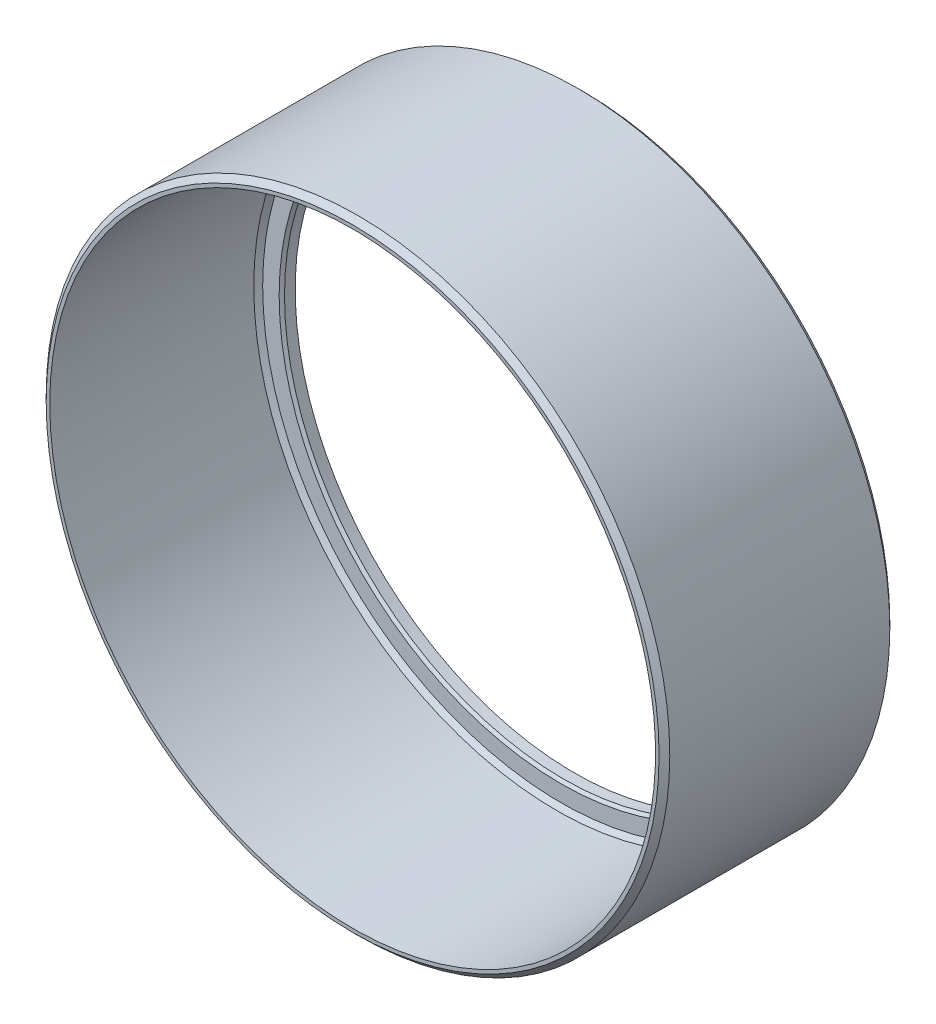
ISO-10303-21;
HEADER;
FILE_DESCRIPTION(('STEP AP214'),'2;1');
FILE_NAME('part.step','',(''),(''),'','','');
FILE_SCHEMA(('AUTOMOTIVE_DESIGN { 1 0 10303 214 1 1 1 1 }'));
ENDSEC;
DATA;
#1=APPLICATION_CONTEXT('core data for automotive mechanical design processes');
#2=APPLICATION_PROTOCOL_DEFINITION('international standard','automotive_design',2000,#1);
#3=PRODUCT_CONTEXT('',#1,'mechanical');
#4=PRODUCT('Part','Part','',(#3));
#5=PRODUCT_RELATED_PRODUCT_CATEGORY('part','',(#4));
#6=PRODUCT_DEFINITION_FORMATION('','',#4);
#7=PRODUCT_DEFINITION_CONTEXT('part definition',#1,'design');
#8=PRODUCT_DEFINITION('design','',#6,#7);
#9=PRODUCT_DEFINITION_SHAPE('','',#8);
#10=(LENGTH_UNIT() NAMED_UNIT(*) SI_UNIT(.MILLI.,.METRE.));
#11=(NAMED_UNIT(*) PLANE_ANGLE_UNIT() SI_UNIT($,.RADIAN.));
#12=(NAMED_UNIT(*) SI_UNIT($,.STERADIAN.) SOLID_ANGLE_UNIT());
#13=UNCERTAINTY_MEASURE_WITH_UNIT(LENGTH_MEASURE(1.E-05),#10,'distance_accuracy_value','');
#14=(GEOMETRIC_REPRESENTATION_CONTEXT(3) GLOBAL_UNCERTAINTY_ASSIGNED_CONTEXT((#13)) GLOBAL_UNIT_ASSIGNED_CONTEXT((#10,
#11,#12)) REPRESENTATION_CONTEXT('',''));
#15=CARTESIAN_POINT('',(0.,0.,0.));
#16=DIRECTION('',(0.,0.,1.));
#17=DIRECTION('',(1.,0.,0.));
#18=AXIS2_PLACEMENT_3D('',#15,#16,#17);
#19=CARTESIAN_POINT('',(0.,-24.5,902.25));
#20=DIRECTION('',(0.,0.,-1.));
#21=DIRECTION('',(1.,0.,0.));
#22=AXIS2_PLACEMENT_3D('',#19,#20,#21);
#23=PLANE('',#22);
#24=CARTESIAN_POINT('',(0.,-24.5,902.25));
#25=DIRECTION('',(0.,0.,-1.));
#26=DIRECTION('',(1.,0.,0.));
#27=AXIS2_PLACEMENT_3D('',#24,#25,#26);
#28=CIRCLE('',#27,32.25);
#29=CARTESIAN_POINT('',(-32.25,-24.5,902.25));
#30=VERTEX_POINT('',#29);
#31=EDGE_CURVE('E110',#30,#30,#28,.T.);
#32=ORIENTED_EDGE('',*,*,#31,.F.);
#33=EDGE_LOOP('',(#32));
#34=FACE_BOUND('',#33,.T.);
#35=CARTESIAN_POINT('',(0.,-24.5,902.25));
#36=DIRECTION('',(0.,0.,-1.));
#37=DIRECTION('',(1.,0.,0.));
#38=AXIS2_PLACEMENT_3D('',#35,#36,#37);
#39=CIRCLE('',#38,33.25);
#40=CARTESIAN_POINT('',(-33.25,-24.5,902.25));
#41=VERTEX_POINT('',#40);
#42=EDGE_CURVE('E99',#41,#41,#39,.T.);
#43=ORIENTED_EDGE('',*,*,#42,.T.);
#44=EDGE_LOOP('',(#43));
#45=FACE_BOUND('',#44,.T.);
#46=ADVANCED_FACE('F17',(#34,#45),#23,.T.);
#47=CARTESIAN_POINT('',(0.,-24.5,903.05));
#48=DIRECTION('',(0.,0.,-1.));
#49=DIRECTION('',(1.,0.,0.));
#50=AXIS2_PLACEMENT_3D('',#47,#48,#49);
#51=PLANE('',#50);
#52=CARTESIAN_POINT('',(0.,-24.5,903.05));
#53=DIRECTION('',(0.,0.,-1.));
#54=DIRECTION('',(1.,0.,0.));
#55=AXIS2_PLACEMENT_3D('',#52,#53,#54);
#56=CIRCLE('',#55,31.65);
#57=CARTESIAN_POINT('',(-31.65,-24.5,903.05));
#58=VERTEX_POINT('',#57);
#59=EDGE_CURVE('E21',#58,#58,#56,.T.);
#60=ORIENTED_EDGE('',*,*,#59,.T.);
#61=EDGE_LOOP('',(#60));
#62=FACE_BOUND('',#61,.T.);
#63=CARTESIAN_POINT('',(0.,-24.5,903.05));
#64=DIRECTION('',(0.,0.,1.));
#65=DIRECTION('',(1.,0.,0.));
#66=AXIS2_PLACEMENT_3D('',#63,#64,#65);
#67=CIRCLE('',#66,33.5);
#68=CARTESIAN_POINT('',(-33.5,-24.5,903.05));
#69=VERTEX_POINT('',#68);
#70=EDGE_CURVE('E60',#69,#69,#67,.T.);
#71=ORIENTED_EDGE('',*,*,#70,.T.);
#72=EDGE_LOOP('',(#71));
#73=FACE_BOUND('',#72,.T.);
#74=ADVANCED_FACE('F203',(#62,#73),#51,.F.);
#75=CARTESIAN_POINT('',(0.,-24.5,900.55));
#76=DIRECTION('',(0.,0.,1.));
#77=DIRECTION('',(0.,-1.,0.));
#78=AXIS2_PLACEMENT_3D('',#75,#76,#77);
#79=PLANE('',#78);
#80=CARTESIAN_POINT('',(0.,-24.5,900.55));
#81=DIRECTION('',(0.,0.,1.));
#82=DIRECTION('',(-1.,0.,0.));
#83=AXIS2_PLACEMENT_3D('',#80,#81,#82);
#84=CIRCLE('',#83,33.5);
#85=CARTESIAN_POINT('',(33.5,-24.5,900.55));
#86=VERTEX_POINT('',#85);
#87=EDGE_CURVE('E134',#86,#86,#84,.T.);
#88=ORIENTED_EDGE('',*,*,#87,.T.);
#89=EDGE_LOOP('',(#88));
#90=FACE_BOUND('',#89,.T.);
#91=CARTESIAN_POINT('',(0.,-24.5,900.55));
#92=DIRECTION('',(0.,0.,-1.));
#93=DIRECTION('',(-1.,0.,0.));
#94=AXIS2_PLACEMENT_3D('',#91,#92,#93);
#95=CIRCLE('',#94,34.4);
#96=CARTESIAN_POINT('',(-34.4,-24.5,900.55));
#97=VERTEX_POINT('',#96);
#98=EDGE_CURVE('E126',#97,#97,#95,.T.);
#99=ORIENTED_EDGE('',*,*,#98,.T.);
#100=EDGE_LOOP('',(#99));
#101=FACE_BOUND('',#100,.T.);
#102=ADVANCED_FACE('F198',(#90,#101),#79,.F.);
#103=CARTESIAN_POINT('',(0.,-24.5,926.45));
#104=DIRECTION('',(0.,0.,1.));
#105=DIRECTION('',(0.,-1.,0.));
#106=AXIS2_PLACEMENT_3D('',#103,#104,#105);
#107=PLANE('',#106);
#108=CARTESIAN_POINT('',(0.,-24.5,926.45));
#109=DIRECTION('',(0.,0.,1.));
#110=DIRECTION('',(-1.,0.,0.));
#111=AXIS2_PLACEMENT_3D('',#108,#109,#110);
#112=CIRCLE('',#111,34.);
#113=CARTESIAN_POINT('',(-34.,-24.5,926.45));
#114=VERTEX_POINT('',#113);
#115=EDGE_CURVE('E11',#114,#114,#112,.T.);
#116=ORIENTED_EDGE('',*,*,#115,.F.);
#117=EDGE_LOOP('',(#116));
#118=FACE_BOUND('',#117,.T.);
#119=CARTESIAN_POINT('',(0.,-24.5,926.45));
#120=DIRECTION('',(0.,0.,1.));
#121=DIRECTION('',(-1.,0.,0.));
#122=AXIS2_PLACEMENT_3D('',#119,#120,#121);
#123=CIRCLE('',#122,34.4);
#124=CARTESIAN_POINT('',(34.4,-24.5,926.45));
#125=VERTEX_POINT('',#124);
#126=EDGE_CURVE('E127',#125,#125,#123,.T.);
#127=ORIENTED_EDGE('',*,*,#126,.T.);
#128=EDGE_LOOP('',(#127));
#129=FACE_BOUND('',#128,.T.);
#130=ADVANCED_FACE('F202',(#118,#129),#107,.T.);
#131=CARTESIAN_POINT('',(0.,-24.5,901.55));
#132=DIRECTION('',(0.,0.,-1.));
#133=DIRECTION('',(1.,0.,0.));
#134=AXIS2_PLACEMENT_3D('',#131,#132,#133);
#135=PLANE('',#134);
#136=CARTESIAN_POINT('',(0.,-24.5,901.55));
#137=DIRECTION('',(0.,0.,-1.));
#138=DIRECTION('',(1.,0.,0.));
#139=AXIS2_PLACEMENT_3D('',#136,#137,#138);
#140=CIRCLE('',#139,31.35);
#141=CARTESIAN_POINT('',(31.35,-24.5,901.55));
#142=VERTEX_POINT('',#141);
#143=EDGE_CURVE('E116',#142,#142,#140,.T.);
#144=ORIENTED_EDGE('',*,*,#143,.F.);
#145=EDGE_LOOP('',(#144));
#146=FACE_BOUND('',#145,.T.);
#147=CARTESIAN_POINT('',(0.,-24.5,901.55));
#148=DIRECTION('',(0.,0.,-1.));
#149=DIRECTION('',(1.,0.,0.));
#150=AXIS2_PLACEMENT_3D('',#147,#148,#149);
#151=CIRCLE('',#150,32.25);
#152=CARTESIAN_POINT('',(32.25,-24.5,901.55));
#153=VERTEX_POINT('',#152);
#154=EDGE_CURVE('E106',#153,#153,#151,.T.);
#155=ORIENTED_EDGE('',*,*,#154,.T.);
#156=EDGE_LOOP('',(#155));
#157=FACE_BOUND('',#156,.T.);
#158=ADVANCED_FACE('F107',(#146,#157),#135,.T.);
#159=CARTESIAN_POINT('',(0.,-24.5,926.45));
#160=DIRECTION('',(0.,0.,-1.));
#161=DIRECTION('',(1.,0.,0.));
#162=AXIS2_PLACEMENT_3D('',#159,#160,#161);
#163=CYLINDRICAL_SURFACE('',#162,34.);
#164=CARTESIAN_POINT('',(0.,-24.5,903.55));
#165=DIRECTION('',(0.,0.,-1.));
#166=DIRECTION('',(1.,0.,0.));
#167=AXIS2_PLACEMENT_3D('',#164,#165,#166);
#168=CIRCLE('',#167,34.);
#169=CARTESIAN_POINT('',(-34.,-24.5,903.55));
#170=VERTEX_POINT('',#169);
#171=EDGE_CURVE('E70',#170,#170,#168,.T.);
#172=ORIENTED_EDGE('',*,*,#171,.T.);
#173=EDGE_LOOP('',(#172));
#174=FACE_BOUND('',#173,.T.);
#175=ORIENTED_EDGE('',*,*,#115,.T.);
#176=EDGE_LOOP('',(#175));
#177=FACE_BOUND('',#176,.T.);
#178=ADVANCED_FACE('F19',(#174,#177),#163,.F.);
#179=CARTESIAN_POINT('',(0.,-24.5,926.45));
#180=DIRECTION('',(0.,0.,-1.));
#181=DIRECTION('',(1.,0.,0.));
#182=AXIS2_PLACEMENT_3D('',#179,#180,#181);
#183=CYLINDRICAL_SURFACE('',#182,35.);
#184=CARTESIAN_POINT('',(0.,-24.5,901.15));
#185=DIRECTION('',(0.,0.,1.));
#186=DIRECTION('',(-1.,0.,0.));
#187=AXIS2_PLACEMENT_3D('',#184,#185,#186);
#188=CIRCLE('',#187,35.);
#189=CARTESIAN_POINT('',(-35.,-24.5,901.15));
#190=VERTEX_POINT('',#189);
#191=EDGE_CURVE('E28',#190,#190,#188,.T.);
#192=ORIENTED_EDGE('',*,*,#191,.T.);
#193=EDGE_LOOP('',(#192));
#194=FACE_BOUND('',#193,.T.);
#195=CARTESIAN_POINT('',(0.,-24.5,925.85));
#196=DIRECTION('',(0.,0.,-1.));
#197=DIRECTION('',(-1.,0.,0.));
#198=AXIS2_PLACEMENT_3D('',#195,#196,#197);
#199=CIRCLE('',#198,35.);
#200=CARTESIAN_POINT('',(35.,-24.5,925.85));
#201=VERTEX_POINT('',#200);
#202=EDGE_CURVE('E123',#201,#201,#199,.T.);
#203=ORIENTED_EDGE('',*,*,#202,.T.);
#204=EDGE_LOOP('',(#203));
#205=FACE_BOUND('',#204,.T.);
#206=ADVANCED_FACE('F262',(#194,#205),#183,.T.);
#207=CARTESIAN_POINT('',(0.,-24.5,901.15));
#208=DIRECTION('',(0.,0.,1.));
#209=DIRECTION('',(-1.,0.,0.));
#210=AXIS2_PLACEMENT_3D('',#207,#208,#209);
#211=CONICAL_SURFACE('',#210,35.,0.785398163397448);
#212=ORIENTED_EDGE('',*,*,#191,.F.);
#213=EDGE_LOOP('',(#212));
#214=FACE_BOUND('',#213,.T.);
#215=ORIENTED_EDGE('',*,*,#98,.F.);
#216=EDGE_LOOP('',(#215));
#217=FACE_BOUND('',#216,.T.);
#218=ADVANCED_FACE('F244',(#214,#217),#211,.T.);
#219=CARTESIAN_POINT('',(0.,-24.5,926.45));
#220=DIRECTION('',(0.,0.,-1.));
#221=DIRECTION('',(1.,0.,0.));
#222=AXIS2_PLACEMENT_3D('',#219,#220,#221);
#223=CONICAL_SURFACE('',#222,34.4,0.785398163397442);
#224=ORIENTED_EDGE('',*,*,#202,.F.);
#225=EDGE_LOOP('',(#224));
#226=FACE_BOUND('',#225,.T.);
#227=ORIENTED_EDGE('',*,*,#126,.F.);
#228=EDGE_LOOP('',(#227));
#229=FACE_BOUND('',#228,.T.);
#230=ADVANCED_FACE('F239',(#226,#229),#223,.T.);
#231=CARTESIAN_POINT('',(0.,-24.5,903.05));
#232=DIRECTION('',(0.,0.,-1.));
#233=DIRECTION('',(1.,0.,0.));
#234=AXIS2_PLACEMENT_3D('',#231,#232,#233);
#235=CYLINDRICAL_SURFACE('',#234,31.35);
#236=ORIENTED_EDGE('',*,*,#143,.T.);
#237=EDGE_LOOP('',(#236));
#238=FACE_BOUND('',#237,.T.);
#239=CARTESIAN_POINT('',(0.,-24.5,902.75));
#240=DIRECTION('',(0.,0.,1.));
#241=DIRECTION('',(1.,0.,0.));
#242=AXIS2_PLACEMENT_3D('',#239,#240,#241);
#243=CIRCLE('',#242,31.35);
#244=CARTESIAN_POINT('',(-31.35,-24.5,902.75));
#245=VERTEX_POINT('',#244);
#246=EDGE_CURVE('E131',#245,#245,#243,.T.);
#247=ORIENTED_EDGE('',*,*,#246,.T.);
#248=EDGE_LOOP('',(#247));
#249=FACE_BOUND('',#248,.T.);
#250=ADVANCED_FACE('F214',(#238,#249),#235,.F.);
#251=CARTESIAN_POINT('',(0.,-24.5,900.55));
#252=DIRECTION('',(0.,0.,1.));
#253=DIRECTION('',(-1.,0.,0.));
#254=AXIS2_PLACEMENT_3D('',#251,#252,#253);
#255=CYLINDRICAL_SURFACE('',#254,33.25);
#256=ORIENTED_EDGE('',*,*,#42,.F.);
#257=EDGE_LOOP('',(#256));
#258=FACE_BOUND('',#257,.T.);
#259=CARTESIAN_POINT('',(0.,-24.5,900.8));
#260=DIRECTION('',(0.,0.,-1.));
#261=DIRECTION('',(-1.,0.,0.));
#262=AXIS2_PLACEMENT_3D('',#259,#260,#261);
#263=CIRCLE('',#262,33.25);
#264=CARTESIAN_POINT('',(33.25,-24.5,900.8));
#265=VERTEX_POINT('',#264);
#266=EDGE_CURVE('E129',#265,#265,#263,.T.);
#267=ORIENTED_EDGE('',*,*,#266,.T.);
#268=EDGE_LOOP('',(#267));
#269=FACE_BOUND('',#268,.T.);
#270=ADVANCED_FACE('F209',(#258,#269),#255,.F.);
#271=CARTESIAN_POINT('',(0.,-24.5,902.25));
#272=DIRECTION('',(0.,0.,-1.));
#273=DIRECTION('',(1.,0.,0.));
#274=AXIS2_PLACEMENT_3D('',#271,#272,#273);
#275=CYLINDRICAL_SURFACE('',#274,32.25);
#276=ORIENTED_EDGE('',*,*,#154,.F.);
#277=EDGE_LOOP('',(#276));
#278=FACE_BOUND('',#277,.T.);
#279=ORIENTED_EDGE('',*,*,#31,.T.);
#280=EDGE_LOOP('',(#279));
#281=FACE_BOUND('',#280,.T.);
#282=ADVANCED_FACE('F213',(#278,#281),#275,.T.);
#283=CARTESIAN_POINT('',(0.,-24.5,903.05));
#284=DIRECTION('',(0.,0.,1.));
#285=DIRECTION('',(-1.,0.,0.));
#286=AXIS2_PLACEMENT_3D('',#283,#284,#285);
#287=CONICAL_SURFACE('',#286,31.65,0.785398163397448);
#288=ORIENTED_EDGE('',*,*,#59,.F.);
#289=EDGE_LOOP('',(#288));
#290=FACE_BOUND('',#289,.T.);
#291=ORIENTED_EDGE('',*,*,#246,.F.);
#292=EDGE_LOOP('',(#291));
#293=FACE_BOUND('',#292,.T.);
#294=ADVANCED_FACE('F220',(#290,#293),#287,.F.);
#295=CARTESIAN_POINT('',(0.,-24.5,900.8));
#296=DIRECTION('',(0.,0.,-1.));
#297=DIRECTION('',(1.,0.,0.));
#298=AXIS2_PLACEMENT_3D('',#295,#296,#297);
#299=CONICAL_SURFACE('',#298,33.25,0.785398163397435);
#300=ORIENTED_EDGE('',*,*,#87,.F.);
#301=EDGE_LOOP('',(#300));
#302=FACE_BOUND('',#301,.T.);
#303=ORIENTED_EDGE('',*,*,#266,.F.);
#304=EDGE_LOOP('',(#303));
#305=FACE_BOUND('',#304,.T.);
#306=ADVANCED_FACE('F224',(#302,#305),#299,.F.);
#307=CARTESIAN_POINT('',(0.,-24.5,903.55));
#308=DIRECTION('',(0.,0.,1.));
#309=DIRECTION('',(-1.,0.,0.));
#310=AXIS2_PLACEMENT_3D('',#307,#308,#309);
#311=CONICAL_SURFACE('',#310,34.,0.785398163397441);
#312=ORIENTED_EDGE('',*,*,#171,.F.);
#313=EDGE_LOOP('',(#312));
#314=FACE_BOUND('',#313,.T.);
#315=ORIENTED_EDGE('',*,*,#70,.F.);
#316=EDGE_LOOP('',(#315));
#317=FACE_BOUND('',#316,.T.);
#318=ADVANCED_FACE('F230',(#314,#317),#311,.F.);
#319=CLOSED_SHELL('',(#46,#74,#102,#130,#158,#178,#206,#218,#230,#250,#270,#282,#294,#306,#318));
#320=MANIFOLD_SOLID_BREP('B1',#319);
#321=ADVANCED_BREP_SHAPE_REPRESENTATION('',(#18,#320),#14);
#322=SHAPE_DEFINITION_REPRESENTATION(#9,#321);
ENDSEC;
END-ISO-10303-21;
